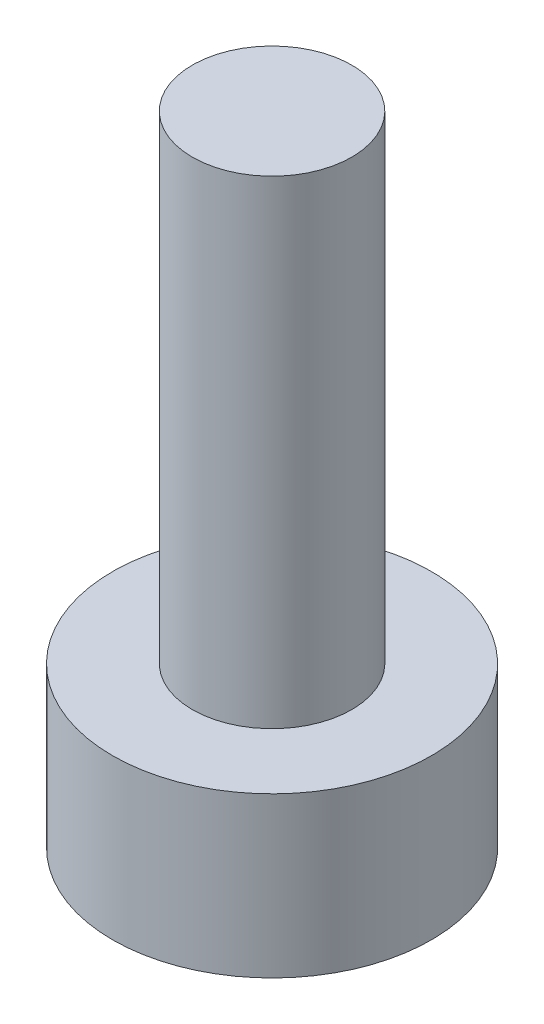
ISO-10303-21;
HEADER;
FILE_DESCRIPTION(('STEP AP214'),'2;1');
FILE_NAME('part.step','',(''),(''),'','','');
FILE_SCHEMA(('AUTOMOTIVE_DESIGN { 1 0 10303 214 1 1 1 1 }'));
ENDSEC;
DATA;
#1=APPLICATION_CONTEXT('core data for automotive mechanical design processes');
#2=APPLICATION_PROTOCOL_DEFINITION('international standard','automotive_design',2000,#1);
#3=PRODUCT_CONTEXT('',#1,'mechanical');
#4=PRODUCT('Part','Part','',(#3));
#5=PRODUCT_RELATED_PRODUCT_CATEGORY('part','',(#4));
#6=PRODUCT_DEFINITION_FORMATION('','',#4);
#7=PRODUCT_DEFINITION_CONTEXT('part definition',#1,'design');
#8=PRODUCT_DEFINITION('design','',#6,#7);
#9=PRODUCT_DEFINITION_SHAPE('','',#8);
#10=(LENGTH_UNIT() NAMED_UNIT(*) SI_UNIT(.MILLI.,.METRE.));
#11=(NAMED_UNIT(*) PLANE_ANGLE_UNIT() SI_UNIT($,.RADIAN.));
#12=(NAMED_UNIT(*) SI_UNIT($,.STERADIAN.) SOLID_ANGLE_UNIT());
#13=UNCERTAINTY_MEASURE_WITH_UNIT(LENGTH_MEASURE(1.E-05),#10,'distance_accuracy_value','');
#14=(GEOMETRIC_REPRESENTATION_CONTEXT(3) GLOBAL_UNCERTAINTY_ASSIGNED_CONTEXT((#13)) GLOBAL_UNIT_ASSIGNED_CONTEXT((#10,
#11,#12)) REPRESENTATION_CONTEXT('',''));
#15=CARTESIAN_POINT('',(0.,0.,0.));
#16=DIRECTION('',(0.,0.,1.));
#17=DIRECTION('',(1.,0.,0.));
#18=AXIS2_PLACEMENT_3D('',#15,#16,#17);
#19=CARTESIAN_POINT('',(0.,2.,0.));
#20=DIRECTION('',(0.,-1.,0.));
#21=DIRECTION('',(0.,0.,-1.));
#22=AXIS2_PLACEMENT_3D('',#19,#20,#21);
#23=CYLINDRICAL_SURFACE('',#22,2.);
#24=CARTESIAN_POINT('',(0.,2.,0.));
#25=DIRECTION('',(0.,1.,0.));
#26=DIRECTION('',(0.,0.,1.));
#27=AXIS2_PLACEMENT_3D('',#24,#25,#26);
#28=CIRCLE('',#27,2.);
#29=CARTESIAN_POINT('',(0.,2.,2.));
#30=VERTEX_POINT('',#29);
#31=EDGE_CURVE('E10',#30,#30,#28,.T.);
#32=ORIENTED_EDGE('',*,*,#31,.F.);
#33=EDGE_LOOP('',(#32));
#34=FACE_BOUND('',#33,.T.);
#35=CARTESIAN_POINT('',(0.,0.,0.));
#36=DIRECTION('',(0.,1.,0.));
#37=DIRECTION('',(0.,0.,1.));
#38=AXIS2_PLACEMENT_3D('',#35,#36,#37);
#39=CIRCLE('',#38,2.);
#40=CARTESIAN_POINT('',(0.,0.,2.));
#41=VERTEX_POINT('',#40);
#42=EDGE_CURVE('E37',#41,#41,#39,.T.);
#43=ORIENTED_EDGE('',*,*,#42,.T.);
#44=EDGE_LOOP('',(#43));
#45=FACE_BOUND('',#44,.T.);
#46=ADVANCED_FACE('F40',(#34,#45),#23,.T.);
#47=CARTESIAN_POINT('',(0.,2.,0.));
#48=DIRECTION('',(0.,1.,0.));
#49=DIRECTION('',(0.,0.,1.));
#50=AXIS2_PLACEMENT_3D('',#47,#48,#49);
#51=PLANE('',#50);
#52=CARTESIAN_POINT('',(0.,2.,0.));
#53=DIRECTION('',(0.,1.,0.));
#54=DIRECTION('',(0.,0.,1.));
#55=AXIS2_PLACEMENT_3D('',#52,#53,#54);
#56=CIRCLE('',#55,1.);
#57=CARTESIAN_POINT('',(0.,2.,1.));
#58=VERTEX_POINT('',#57);
#59=EDGE_CURVE('E50',#58,#58,#56,.F.);
#60=ORIENTED_EDGE('',*,*,#59,.T.);
#61=EDGE_LOOP('',(#60));
#62=FACE_BOUND('',#61,.T.);
#63=ORIENTED_EDGE('',*,*,#31,.T.);
#64=EDGE_LOOP('',(#63));
#65=FACE_BOUND('',#64,.T.);
#66=ADVANCED_FACE('F70',(#62,#65),#51,.T.);
#67=CARTESIAN_POINT('',(0.,0.,0.));
#68=DIRECTION('',(0.,1.,0.));
#69=DIRECTION('',(0.,0.,1.));
#70=AXIS2_PLACEMENT_3D('',#67,#68,#69);
#71=PLANE('',#70);
#72=ORIENTED_EDGE('',*,*,#42,.F.);
#73=EDGE_LOOP('',(#72));
#74=FACE_BOUND('',#73,.T.);
#75=ADVANCED_FACE('F56',(#74),#71,.F.);
#76=CARTESIAN_POINT('',(0.,8.,0.));
#77=DIRECTION('',(0.,-1.,0.));
#78=DIRECTION('',(0.,0.,-1.));
#79=AXIS2_PLACEMENT_3D('',#76,#77,#78);
#80=CYLINDRICAL_SURFACE('',#79,1.);
#81=ORIENTED_EDGE('',*,*,#59,.F.);
#82=EDGE_LOOP('',(#81));
#83=FACE_BOUND('',#82,.T.);
#84=CARTESIAN_POINT('',(0.,8.,0.));
#85=DIRECTION('',(0.,1.,0.));
#86=DIRECTION('',(0.,0.,1.));
#87=AXIS2_PLACEMENT_3D('',#84,#85,#86);
#88=CIRCLE('',#87,1.);
#89=CARTESIAN_POINT('',(0.,8.,1.));
#90=VERTEX_POINT('',#89);
#91=EDGE_CURVE('E51',#90,#90,#88,.T.);
#92=ORIENTED_EDGE('',*,*,#91,.F.);
#93=EDGE_LOOP('',(#92));
#94=FACE_BOUND('',#93,.T.);
#95=ADVANCED_FACE('F60',(#83,#94),#80,.T.);
#96=CARTESIAN_POINT('',(0.,8.,0.));
#97=DIRECTION('',(0.,1.,0.));
#98=DIRECTION('',(0.,0.,1.));
#99=AXIS2_PLACEMENT_3D('',#96,#97,#98);
#100=PLANE('',#99);
#101=ORIENTED_EDGE('',*,*,#91,.T.);
#102=EDGE_LOOP('',(#101));
#103=FACE_BOUND('',#102,.T.);
#104=ADVANCED_FACE('F54',(#103),#100,.T.);
#105=CLOSED_SHELL('',(#46,#66,#75,#95,#104));
#106=MANIFOLD_SOLID_BREP('B2',#105);
#107=ADVANCED_BREP_SHAPE_REPRESENTATION('',(#18,#106),#14);
#108=SHAPE_DEFINITION_REPRESENTATION(#9,#107);
ENDSEC;
END-ISO-10303-21;
